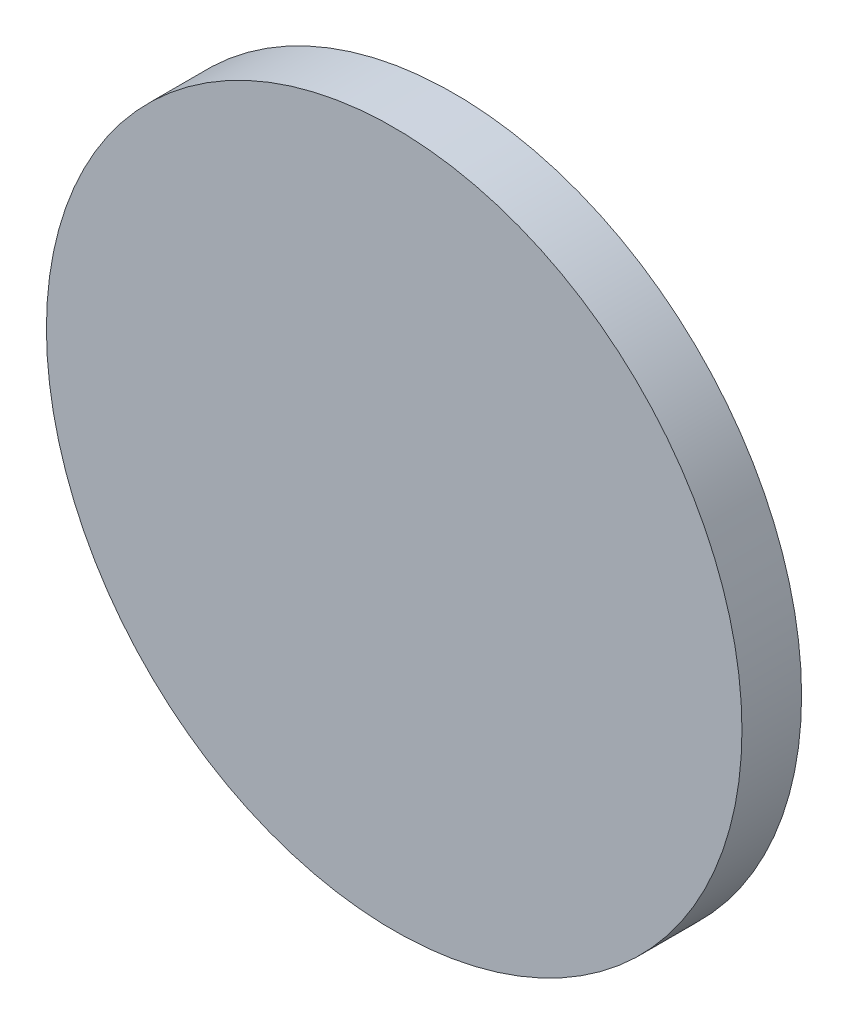
ISO-10303-21;
HEADER;
FILE_DESCRIPTION(('STEP AP214'),'2;1');
FILE_NAME('part.step','',(''),(''),'','','');
FILE_SCHEMA(('AUTOMOTIVE_DESIGN { 1 0 10303 214 1 1 1 1 }'));
ENDSEC;
DATA;
#1=APPLICATION_CONTEXT('core data for automotive mechanical design processes');
#2=APPLICATION_PROTOCOL_DEFINITION('international standard','automotive_design',2000,#1);
#3=PRODUCT_CONTEXT('',#1,'mechanical');
#4=PRODUCT('Part','Part','',(#3));
#5=PRODUCT_RELATED_PRODUCT_CATEGORY('part','',(#4));
#6=PRODUCT_DEFINITION_FORMATION('','',#4);
#7=PRODUCT_DEFINITION_CONTEXT('part definition',#1,'design');
#8=PRODUCT_DEFINITION('design','',#6,#7);
#9=PRODUCT_DEFINITION_SHAPE('','',#8);
#10=(LENGTH_UNIT() NAMED_UNIT(*) SI_UNIT(.MILLI.,.METRE.));
#11=(NAMED_UNIT(*) PLANE_ANGLE_UNIT() SI_UNIT($,.RADIAN.));
#12=(NAMED_UNIT(*) SI_UNIT($,.STERADIAN.) SOLID_ANGLE_UNIT());
#13=UNCERTAINTY_MEASURE_WITH_UNIT(LENGTH_MEASURE(1.E-05),#10,'distance_accuracy_value','');
#14=(GEOMETRIC_REPRESENTATION_CONTEXT(3) GLOBAL_UNCERTAINTY_ASSIGNED_CONTEXT((#13)) GLOBAL_UNIT_ASSIGNED_CONTEXT((#10,
#11,#12)) REPRESENTATION_CONTEXT('',''));
#15=CARTESIAN_POINT('',(0.,0.,0.));
#16=DIRECTION('',(0.,0.,1.));
#17=DIRECTION('',(1.,0.,0.));
#18=AXIS2_PLACEMENT_3D('',#15,#16,#17);
#19=CARTESIAN_POINT('',(11.595,2.386000014875,0.79916));
#20=DIRECTION('',(0.,0.,1.));
#21=DIRECTION('',(1.,0.,0.));
#22=AXIS2_PLACEMENT_3D('',#19,#20,#21);
#23=PLANE('',#22);
#24=CARTESIAN_POINT('',(11.595,2.386000014875,0.79916));
#25=DIRECTION('',(0.,0.,1.));
#26=DIRECTION('',(1.,0.,0.));
#27=AXIS2_PLACEMENT_3D('',#24,#25,#26);
#28=CIRCLE('',#27,0.200024667);
#29=CARTESIAN_POINT('',(11.795024667,2.386000014875,0.79916));
#30=VERTEX_POINT('',#29);
#31=EDGE_CURVE('E18',#30,#30,#28,.F.);
#32=ORIENTED_EDGE('',*,*,#31,.F.);
#33=EDGE_LOOP('',(#32));
#34=FACE_BOUND('',#33,.T.);
#35=ADVANCED_FACE('F15',(#34),#23,.T.);
#36=CARTESIAN_POINT('',(11.595,2.386000014875,0.76487));
#37=DIRECTION('',(0.,0.,1.));
#38=DIRECTION('',(1.,0.,0.));
#39=AXIS2_PLACEMENT_3D('',#36,#37,#38);
#40=CYLINDRICAL_SURFACE('',#39,0.200024667);
#41=ORIENTED_EDGE('',*,*,#31,.T.);
#42=EDGE_LOOP('',(#41));
#43=FACE_BOUND('',#42,.T.);
#44=CARTESIAN_POINT('',(11.595,2.386000014875,0.76487));
#45=DIRECTION('',(0.,0.,1.));
#46=DIRECTION('',(1.,0.,0.));
#47=AXIS2_PLACEMENT_3D('',#44,#45,#46);
#48=CIRCLE('',#47,0.200024667);
#49=CARTESIAN_POINT('',(11.795024667,2.386000014875,0.76487));
#50=VERTEX_POINT('',#49);
#51=EDGE_CURVE('E10',#50,#50,#48,.F.);
#52=ORIENTED_EDGE('',*,*,#51,.F.);
#53=EDGE_LOOP('',(#52));
#54=FACE_BOUND('',#53,.T.);
#55=ADVANCED_FACE('F27',(#43,#54),#40,.T.);
#56=CARTESIAN_POINT('',(11.595,2.386000014875,0.76487));
#57=DIRECTION('',(0.,0.,-1.));
#58=DIRECTION('',(-1.,0.,0.));
#59=AXIS2_PLACEMENT_3D('',#56,#57,#58);
#60=PLANE('',#59);
#61=ORIENTED_EDGE('',*,*,#51,.T.);
#62=EDGE_LOOP('',(#61));
#63=FACE_BOUND('',#62,.T.);
#64=ADVANCED_FACE('F35',(#63),#60,.T.);
#65=CLOSED_SHELL('',(#35,#55,#64));
#66=MANIFOLD_SOLID_BREP('B1',#65);
#67=ADVANCED_BREP_SHAPE_REPRESENTATION('',(#18,#66),#14);
#68=SHAPE_DEFINITION_REPRESENTATION(#9,#67);
ENDSEC;
END-ISO-10303-21;
